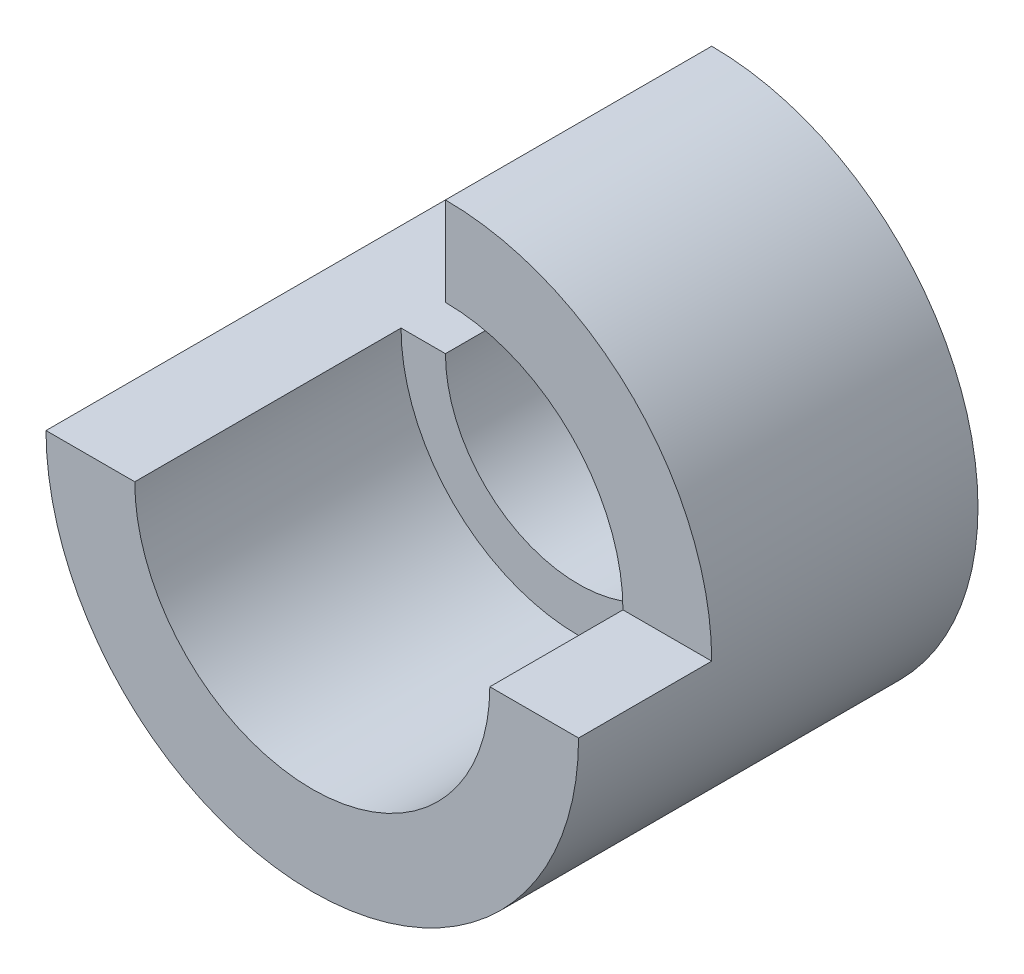
ISO-10303-21;
HEADER;
FILE_DESCRIPTION(('STEP AP214'),'2;1');
FILE_NAME('part.step','',(''),(''),'','','');
FILE_SCHEMA(('AUTOMOTIVE_DESIGN { 1 0 10303 214 1 1 1 1 }'));
ENDSEC;
DATA;
#1=APPLICATION_CONTEXT('core data for automotive mechanical design processes');
#2=APPLICATION_PROTOCOL_DEFINITION('international standard','automotive_design',2000,#1);
#3=PRODUCT_CONTEXT('',#1,'mechanical');
#4=PRODUCT('Part','Part','',(#3));
#5=PRODUCT_RELATED_PRODUCT_CATEGORY('part','',(#4));
#6=PRODUCT_DEFINITION_FORMATION('','',#4);
#7=PRODUCT_DEFINITION_CONTEXT('part definition',#1,'design');
#8=PRODUCT_DEFINITION('design','',#6,#7);
#9=PRODUCT_DEFINITION_SHAPE('','',#8);
#10=(LENGTH_UNIT() NAMED_UNIT(*) SI_UNIT(.MILLI.,.METRE.));
#11=(NAMED_UNIT(*) PLANE_ANGLE_UNIT() SI_UNIT($,.RADIAN.));
#12=(NAMED_UNIT(*) SI_UNIT($,.STERADIAN.) SOLID_ANGLE_UNIT());
#13=UNCERTAINTY_MEASURE_WITH_UNIT(LENGTH_MEASURE(1.E-05),#10,'distance_accuracy_value','');
#14=(GEOMETRIC_REPRESENTATION_CONTEXT(3) GLOBAL_UNCERTAINTY_ASSIGNED_CONTEXT((#13)) GLOBAL_UNIT_ASSIGNED_CONTEXT((#10,
#11,#12)) REPRESENTATION_CONTEXT('',''));
#15=CARTESIAN_POINT('',(0.,0.,0.));
#16=DIRECTION('',(0.,0.,1.));
#17=DIRECTION('',(1.,0.,0.));
#18=AXIS2_PLACEMENT_3D('',#15,#16,#17);
#19=CARTESIAN_POINT('',(0.,0.,9.));
#20=DIRECTION('',(0.,0.,-1.));
#21=DIRECTION('',(-1.,0.,0.));
#22=AXIS2_PLACEMENT_3D('',#19,#20,#21);
#23=CYLINDRICAL_SURFACE('',#22,3.);
#24=CARTESIAN_POINT('',(0.,0.,3.));
#25=DIRECTION('',(0.,0.,1.));
#26=DIRECTION('',(1.,0.,0.));
#27=AXIS2_PLACEMENT_3D('',#24,#25,#26);
#28=CIRCLE('',#27,3.);
#29=CARTESIAN_POINT('',(0.,3.,3.));
#30=VERTEX_POINT('',#29);
#31=CARTESIAN_POINT('',(-3.,0.,3.));
#32=VERTEX_POINT('',#31);
#33=EDGE_CURVE('E141',#30,#32,#28,.F.);
#34=ORIENTED_EDGE('',*,*,#33,.F.);
#35=DIRECTION('',(0.,0.,-1.));
#36=VECTOR('',#35,1.);
#37=CARTESIAN_POINT('',(0.,3.,9.));
#38=LINE('',#37,#36);
#39=CARTESIAN_POINT('',(0.,3.,0.));
#40=VERTEX_POINT('',#39);
#41=EDGE_CURVE('E90',#30,#40,#38,.T.);
#42=ORIENTED_EDGE('',*,*,#41,.T.);
#43=CARTESIAN_POINT('',(0.,0.,0.));
#44=DIRECTION('',(0.,0.,-1.));
#45=DIRECTION('',(1.,0.,0.));
#46=AXIS2_PLACEMENT_3D('',#43,#44,#45);
#47=CIRCLE('',#46,3.);
#48=CARTESIAN_POINT('',(-3.,0.,0.));
#49=VERTEX_POINT('',#48);
#50=EDGE_CURVE('E103',#40,#49,#47,.T.);
#51=ORIENTED_EDGE('',*,*,#50,.T.);
#52=DIRECTION('',(0.,0.,-1.));
#53=VECTOR('',#52,1.);
#54=CARTESIAN_POINT('',(-3.,0.,9.));
#55=LINE('',#54,#53);
#56=EDGE_CURVE('E111',#32,#49,#55,.T.);
#57=ORIENTED_EDGE('',*,*,#56,.F.);
#58=EDGE_LOOP('',(#34,#42,#51,#57));
#59=FACE_BOUND('',#58,.T.);
#60=ADVANCED_FACE('F33',(#59),#23,.F.);
#61=CARTESIAN_POINT('',(0.,3.,9.));
#62=DIRECTION('',(1.,0.,0.));
#63=DIRECTION('',(0.,0.,-1.));
#64=AXIS2_PLACEMENT_3D('',#61,#62,#63);
#65=PLANE('',#64);
#66=DIRECTION('',(0.,-1.,0.));
#67=VECTOR('',#66,1.);
#68=CARTESIAN_POINT('',(0.,3.,3.));
#69=LINE('',#68,#67);
#70=CARTESIAN_POINT('',(0.,4.,3.));
#71=VERTEX_POINT('',#70);
#72=EDGE_CURVE('E144',#71,#30,#69,.T.);
#73=ORIENTED_EDGE('',*,*,#72,.F.);
#74=DIRECTION('',(0.,0.,1.));
#75=VECTOR('',#74,1.);
#76=CARTESIAN_POINT('',(0.,4.,3.));
#77=LINE('',#76,#75);
#78=CARTESIAN_POINT('',(0.,4.,6.));
#79=VERTEX_POINT('',#78);
#80=EDGE_CURVE('E166',#71,#79,#77,.T.);
#81=ORIENTED_EDGE('',*,*,#80,.T.);
#82=DIRECTION('',(0.,-1.,0.));
#83=VECTOR('',#82,1.);
#84=CARTESIAN_POINT('',(0.,0.,6.));
#85=LINE('',#84,#83);
#86=CARTESIAN_POINT('',(0.,6.,6.));
#87=VERTEX_POINT('',#86);
#88=EDGE_CURVE('E86',#87,#79,#85,.T.);
#89=ORIENTED_EDGE('',*,*,#88,.F.);
#90=DIRECTION('',(0.,0.,-1.));
#91=VECTOR('',#90,1.);
#92=CARTESIAN_POINT('',(0.,6.,9.));
#93=LINE('',#92,#91);
#94=CARTESIAN_POINT('',(0.,6.,0.));
#95=VERTEX_POINT('',#94);
#96=EDGE_CURVE('E75',#87,#95,#93,.T.);
#97=ORIENTED_EDGE('',*,*,#96,.T.);
#98=DIRECTION('',(0.,-1.,0.));
#99=VECTOR('',#98,1.);
#100=CARTESIAN_POINT('',(0.,3.,0.));
#101=LINE('',#100,#99);
#102=EDGE_CURVE('E81',#95,#40,#101,.T.);
#103=ORIENTED_EDGE('',*,*,#102,.T.);
#104=ORIENTED_EDGE('',*,*,#41,.F.);
#105=EDGE_LOOP('',(#73,#81,#89,#97,#103,#104));
#106=FACE_BOUND('',#105,.T.);
#107=ADVANCED_FACE('F78',(#106),#65,.F.);
#108=CARTESIAN_POINT('',(-6.,0.,9.));
#109=DIRECTION('',(0.,-1.,0.));
#110=DIRECTION('',(0.,0.,-1.));
#111=AXIS2_PLACEMENT_3D('',#108,#109,#110);
#112=PLANE('',#111);
#113=DIRECTION('',(-1.,0.,0.));
#114=VECTOR('',#113,1.);
#115=CARTESIAN_POINT('',(-6.,0.,9.));
#116=LINE('',#115,#114);
#117=CARTESIAN_POINT('',(-4.,0.,9.));
#118=VERTEX_POINT('',#117);
#119=CARTESIAN_POINT('',(-6.,0.,9.));
#120=VERTEX_POINT('',#119);
#121=EDGE_CURVE('E55',#118,#120,#116,.T.);
#122=ORIENTED_EDGE('',*,*,#121,.F.);
#123=DIRECTION('',(0.,0.,1.));
#124=VECTOR('',#123,1.);
#125=CARTESIAN_POINT('',(-4.,0.,3.));
#126=LINE('',#125,#124);
#127=CARTESIAN_POINT('',(-4.,0.,3.));
#128=VERTEX_POINT('',#127);
#129=EDGE_CURVE('E163',#118,#128,#126,.F.);
#130=ORIENTED_EDGE('',*,*,#129,.T.);
#131=DIRECTION('',(-1.,0.,0.));
#132=VECTOR('',#131,1.);
#133=CARTESIAN_POINT('',(-6.,0.,3.));
#134=LINE('',#133,#132);
#135=EDGE_CURVE('E11',#32,#128,#134,.T.);
#136=ORIENTED_EDGE('',*,*,#135,.F.);
#137=ORIENTED_EDGE('',*,*,#56,.T.);
#138=DIRECTION('',(-1.,0.,0.));
#139=VECTOR('',#138,1.);
#140=CARTESIAN_POINT('',(-6.,0.,0.));
#141=LINE('',#140,#139);
#142=CARTESIAN_POINT('',(-6.,0.,0.));
#143=VERTEX_POINT('',#142);
#144=EDGE_CURVE('E99',#49,#143,#141,.T.);
#145=ORIENTED_EDGE('',*,*,#144,.T.);
#146=DIRECTION('',(0.,0.,-1.));
#147=VECTOR('',#146,1.);
#148=CARTESIAN_POINT('',(-6.,0.,9.));
#149=LINE('',#148,#147);
#150=EDGE_CURVE('E89',#120,#143,#149,.T.);
#151=ORIENTED_EDGE('',*,*,#150,.F.);
#152=EDGE_LOOP('',(#122,#130,#136,#137,#145,#151));
#153=FACE_BOUND('',#152,.T.);
#154=ADVANCED_FACE('F134',(#153),#112,.F.);
#155=CARTESIAN_POINT('',(0.,0.,9.));
#156=DIRECTION('',(0.,0.,-1.));
#157=DIRECTION('',(-1.,0.,0.));
#158=AXIS2_PLACEMENT_3D('',#155,#156,#157);
#159=CYLINDRICAL_SURFACE('',#158,6.);
#160=CARTESIAN_POINT('',(0.,0.,6.));
#161=DIRECTION('',(0.,0.,1.));
#162=DIRECTION('',(1.,0.,0.));
#163=AXIS2_PLACEMENT_3D('',#160,#161,#162);
#164=CIRCLE('',#163,6.);
#165=CARTESIAN_POINT('',(6.,0.,6.));
#166=VERTEX_POINT('',#165);
#167=EDGE_CURVE('E132',#166,#87,#164,.T.);
#168=ORIENTED_EDGE('',*,*,#167,.F.);
#169=DIRECTION('',(0.,0.,1.));
#170=VECTOR('',#169,1.);
#171=CARTESIAN_POINT('',(6.,0.,6.));
#172=LINE('',#171,#170);
#173=CARTESIAN_POINT('',(6.,0.,9.));
#174=VERTEX_POINT('',#173);
#175=EDGE_CURVE('E156',#166,#174,#172,.T.);
#176=ORIENTED_EDGE('',*,*,#175,.T.);
#177=CARTESIAN_POINT('',(0.,0.,9.));
#178=DIRECTION('',(0.,0.,1.));
#179=DIRECTION('',(1.,0.,0.));
#180=AXIS2_PLACEMENT_3D('',#177,#178,#179);
#181=CIRCLE('',#180,6.);
#182=EDGE_CURVE('E105',#120,#174,#181,.T.);
#183=ORIENTED_EDGE('',*,*,#182,.F.);
#184=ORIENTED_EDGE('',*,*,#150,.T.);
#185=CARTESIAN_POINT('',(0.,0.,0.));
#186=DIRECTION('',(0.,0.,1.));
#187=DIRECTION('',(1.,0.,0.));
#188=AXIS2_PLACEMENT_3D('',#185,#186,#187);
#189=CIRCLE('',#188,6.);
#190=EDGE_CURVE('E94',#143,#95,#189,.T.);
#191=ORIENTED_EDGE('',*,*,#190,.T.);
#192=ORIENTED_EDGE('',*,*,#96,.F.);
#193=EDGE_LOOP('',(#168,#176,#183,#184,#191,#192));
#194=FACE_BOUND('',#193,.T.);
#195=ADVANCED_FACE('F95',(#194),#159,.T.);
#196=CARTESIAN_POINT('',(0.,0.,9.));
#197=DIRECTION('',(0.,0.,1.));
#198=DIRECTION('',(1.,0.,0.));
#199=AXIS2_PLACEMENT_3D('',#196,#197,#198);
#200=PLANE('',#199);
#201=CARTESIAN_POINT('',(0.,0.,9.));
#202=DIRECTION('',(0.,0.,1.));
#203=DIRECTION('',(1.,0.,0.));
#204=AXIS2_PLACEMENT_3D('',#201,#202,#203);
#205=CIRCLE('',#204,4.);
#206=CARTESIAN_POINT('',(4.,0.,9.));
#207=VERTEX_POINT('',#206);
#208=EDGE_CURVE('E47',#118,#207,#205,.T.);
#209=ORIENTED_EDGE('',*,*,#208,.F.);
#210=ORIENTED_EDGE('',*,*,#121,.T.);
#211=ORIENTED_EDGE('',*,*,#182,.T.);
#212=DIRECTION('',(1.,0.,0.));
#213=VECTOR('',#212,1.);
#214=CARTESIAN_POINT('',(0.,0.,9.));
#215=LINE('',#214,#213);
#216=EDGE_CURVE('E113',#207,#174,#215,.T.);
#217=ORIENTED_EDGE('',*,*,#216,.F.);
#218=EDGE_LOOP('',(#209,#210,#211,#217));
#219=FACE_BOUND('',#218,.T.);
#220=ADVANCED_FACE('F126',(#219),#200,.T.);
#221=CARTESIAN_POINT('',(0.,0.,0.));
#222=DIRECTION('',(0.,0.,1.));
#223=DIRECTION('',(1.,0.,0.));
#224=AXIS2_PLACEMENT_3D('',#221,#222,#223);
#225=PLANE('',#224);
#226=ORIENTED_EDGE('',*,*,#50,.F.);
#227=ORIENTED_EDGE('',*,*,#102,.F.);
#228=ORIENTED_EDGE('',*,*,#190,.F.);
#229=ORIENTED_EDGE('',*,*,#144,.F.);
#230=EDGE_LOOP('',(#226,#227,#228,#229));
#231=FACE_BOUND('',#230,.T.);
#232=ADVANCED_FACE('F101',(#231),#225,.F.);
#233=CARTESIAN_POINT('',(0.,0.,6.));
#234=DIRECTION('',(0.,0.,1.));
#235=DIRECTION('',(1.,0.,0.));
#236=AXIS2_PLACEMENT_3D('',#233,#234,#235);
#237=PLANE('',#236);
#238=CARTESIAN_POINT('',(0.,0.,6.));
#239=DIRECTION('',(0.,0.,1.));
#240=DIRECTION('',(1.,0.,0.));
#241=AXIS2_PLACEMENT_3D('',#238,#239,#240);
#242=CIRCLE('',#241,4.);
#243=CARTESIAN_POINT('',(4.,0.,6.));
#244=VERTEX_POINT('',#243);
#245=EDGE_CURVE('E155',#244,#79,#242,.T.);
#246=ORIENTED_EDGE('',*,*,#245,.F.);
#247=DIRECTION('',(1.,0.,0.));
#248=VECTOR('',#247,1.);
#249=CARTESIAN_POINT('',(6.,0.,6.));
#250=LINE('',#249,#248);
#251=EDGE_CURVE('E123',#244,#166,#250,.T.);
#252=ORIENTED_EDGE('',*,*,#251,.T.);
#253=ORIENTED_EDGE('',*,*,#167,.T.);
#254=ORIENTED_EDGE('',*,*,#88,.T.);
#255=EDGE_LOOP('',(#246,#252,#253,#254));
#256=FACE_BOUND('',#255,.T.);
#257=ADVANCED_FACE('F154',(#256),#237,.T.);
#258=CARTESIAN_POINT('',(6.,0.,6.));
#259=DIRECTION('',(0.,-1.,0.));
#260=DIRECTION('',(0.,0.,-1.));
#261=AXIS2_PLACEMENT_3D('',#258,#259,#260);
#262=PLANE('',#261);
#263=ORIENTED_EDGE('',*,*,#251,.F.);
#264=DIRECTION('',(0.,0.,1.));
#265=VECTOR('',#264,1.);
#266=CARTESIAN_POINT('',(4.,0.,3.));
#267=LINE('',#266,#265);
#268=EDGE_CURVE('E40',#244,#207,#267,.T.);
#269=ORIENTED_EDGE('',*,*,#268,.T.);
#270=ORIENTED_EDGE('',*,*,#216,.T.);
#271=ORIENTED_EDGE('',*,*,#175,.F.);
#272=EDGE_LOOP('',(#263,#269,#270,#271));
#273=FACE_BOUND('',#272,.T.);
#274=ADVANCED_FACE('F118',(#273),#262,.F.);
#275=CARTESIAN_POINT('',(0.,0.,3.));
#276=DIRECTION('',(0.,0.,1.));
#277=DIRECTION('',(1.,0.,0.));
#278=AXIS2_PLACEMENT_3D('',#275,#276,#277);
#279=PLANE('',#278);
#280=ORIENTED_EDGE('',*,*,#72,.T.);
#281=ORIENTED_EDGE('',*,*,#33,.T.);
#282=ORIENTED_EDGE('',*,*,#135,.T.);
#283=CARTESIAN_POINT('',(0.,0.,3.));
#284=DIRECTION('',(0.,0.,1.));
#285=DIRECTION('',(1.,0.,0.));
#286=AXIS2_PLACEMENT_3D('',#283,#284,#285);
#287=CIRCLE('',#286,4.);
#288=EDGE_CURVE('E169',#128,#71,#287,.T.);
#289=ORIENTED_EDGE('',*,*,#288,.T.);
#290=EDGE_LOOP('',(#280,#281,#282,#289));
#291=FACE_BOUND('',#290,.T.);
#292=ADVANCED_FACE('F172',(#291),#279,.T.);
#293=CARTESIAN_POINT('',(0.,0.,3.));
#294=DIRECTION('',(0.,0.,1.));
#295=DIRECTION('',(1.,0.,0.));
#296=AXIS2_PLACEMENT_3D('',#293,#294,#295);
#297=CYLINDRICAL_SURFACE('',#296,4.);
#298=ORIENTED_EDGE('',*,*,#208,.T.);
#299=ORIENTED_EDGE('',*,*,#268,.F.);
#300=ORIENTED_EDGE('',*,*,#245,.T.);
#301=ORIENTED_EDGE('',*,*,#80,.F.);
#302=ORIENTED_EDGE('',*,*,#288,.F.);
#303=ORIENTED_EDGE('',*,*,#129,.F.);
#304=EDGE_LOOP('',(#298,#299,#300,#301,#302,#303));
#305=FACE_BOUND('',#304,.T.);
#306=ADVANCED_FACE('F176',(#305),#297,.F.);
#307=CLOSED_SHELL('',(#60,#107,#154,#195,#220,#232,#257,#274,#292,#306));
#308=MANIFOLD_SOLID_BREP('B2',#307);
#309=ADVANCED_BREP_SHAPE_REPRESENTATION('',(#18,#308),#14);
#310=SHAPE_DEFINITION_REPRESENTATION(#9,#309);
ENDSEC;
END-ISO-10303-21;
